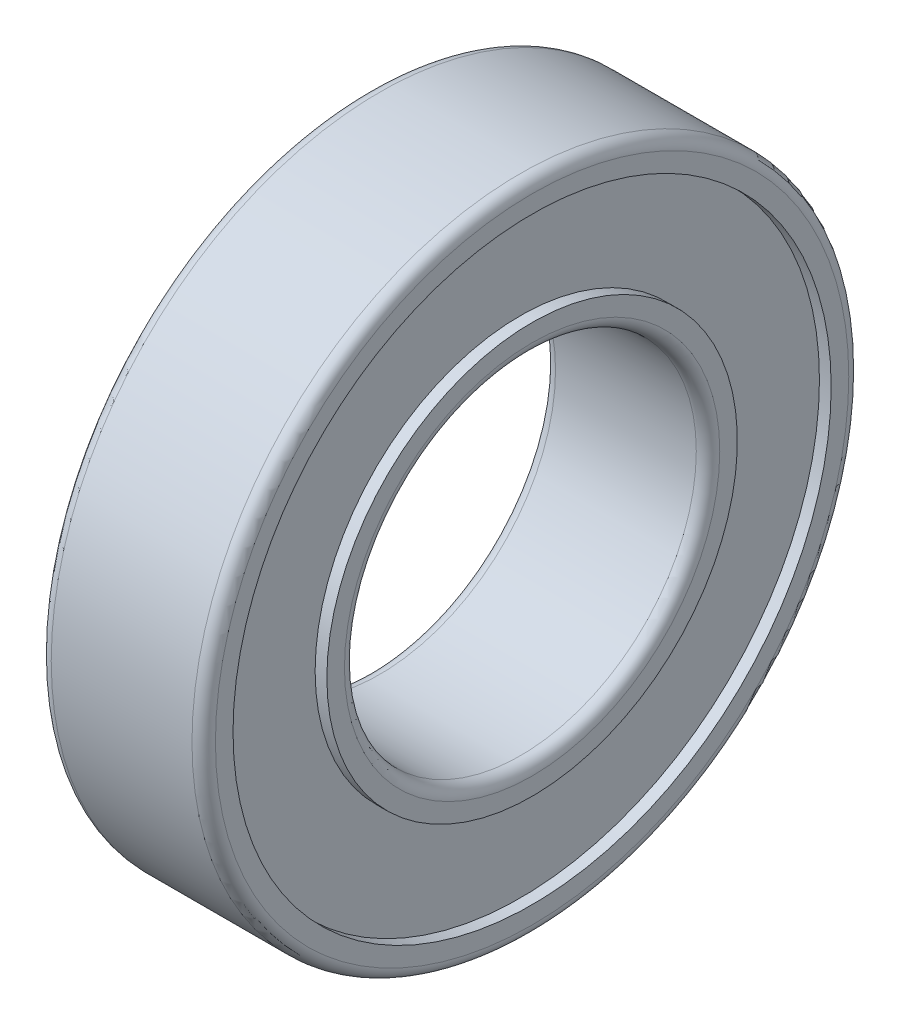
ISO-10303-21;
HEADER;
FILE_DESCRIPTION(('STEP AP214'),'2;1');
FILE_NAME('part.step','',(''),(''),'','','');
FILE_SCHEMA(('AUTOMOTIVE_DESIGN { 1 0 10303 214 1 1 1 1 }'));
ENDSEC;
DATA;
#1=APPLICATION_CONTEXT('core data for automotive mechanical design processes');
#2=APPLICATION_PROTOCOL_DEFINITION('international standard','automotive_design',2000,#1);
#3=PRODUCT_CONTEXT('',#1,'mechanical');
#4=PRODUCT('Part','Part','',(#3));
#5=PRODUCT_RELATED_PRODUCT_CATEGORY('part','',(#4));
#6=PRODUCT_DEFINITION_FORMATION('','',#4);
#7=PRODUCT_DEFINITION_CONTEXT('part definition',#1,'design');
#8=PRODUCT_DEFINITION('design','',#6,#7);
#9=PRODUCT_DEFINITION_SHAPE('','',#8);
#10=(LENGTH_UNIT() NAMED_UNIT(*) SI_UNIT(.MILLI.,.METRE.));
#11=(NAMED_UNIT(*) PLANE_ANGLE_UNIT() SI_UNIT($,.RADIAN.));
#12=(NAMED_UNIT(*) SI_UNIT($,.STERADIAN.) SOLID_ANGLE_UNIT());
#13=UNCERTAINTY_MEASURE_WITH_UNIT(LENGTH_MEASURE(1.E-05),#10,'distance_accuracy_value','');
#14=(GEOMETRIC_REPRESENTATION_CONTEXT(3) GLOBAL_UNCERTAINTY_ASSIGNED_CONTEXT((#13)) GLOBAL_UNIT_ASSIGNED_CONTEXT((#10,
#11,#12)) REPRESENTATION_CONTEXT('',''));
#15=CARTESIAN_POINT('',(0.,0.,0.));
#16=DIRECTION('',(0.,0.,1.));
#17=DIRECTION('',(1.,0.,0.));
#18=AXIS2_PLACEMENT_3D('',#15,#16,#17);
#19=CARTESIAN_POINT('',(0.5,12.75,0.));
#20=DIRECTION('',(1.,0.,0.));
#21=DIRECTION('',(0.,0.,-1.));
#22=AXIS2_PLACEMENT_3D('',#19,#20,#21);
#23=PLANE('',#22);
#24=CARTESIAN_POINT('',(0.5,0.,0.));
#25=DIRECTION('',(-1.,0.,0.));
#26=DIRECTION('',(0.,0.,1.));
#27=AXIS2_PLACEMENT_3D('',#24,#25,#26);
#28=CIRCLE('',#27,8.75);
#29=CARTESIAN_POINT('',(0.5,0.,8.75));
#30=VERTEX_POINT('',#29);
#31=EDGE_CURVE('E305',#30,#30,#28,.T.);
#32=ORIENTED_EDGE('',*,*,#31,.F.);
#33=EDGE_LOOP('',(#32));
#34=FACE_BOUND('',#33,.T.);
#35=CARTESIAN_POINT('',(0.5,0.,0.));
#36=DIRECTION('',(-1.,0.,0.));
#37=DIRECTION('',(0.,0.,1.));
#38=AXIS2_PLACEMENT_3D('',#35,#36,#37);
#39=CIRCLE('',#38,12.75);
#40=CARTESIAN_POINT('',(0.5,0.,12.75));
#41=VERTEX_POINT('',#40);
#42=EDGE_CURVE('E307',#41,#41,#39,.T.);
#43=ORIENTED_EDGE('',*,*,#42,.T.);
#44=EDGE_LOOP('',(#43));
#45=FACE_BOUND('',#44,.T.);
#46=ADVANCED_FACE('F17',(#34,#45),#23,.F.);
#47=CARTESIAN_POINT('',(0.,0.,0.));
#48=DIRECTION('',(-1.,0.,0.));
#49=DIRECTION('',(0.,0.,1.));
#50=AXIS2_PLACEMENT_3D('',#47,#48,#49);
#51=CYLINDRICAL_SURFACE('',#50,12.75);
#52=ORIENTED_EDGE('',*,*,#42,.F.);
#53=EDGE_LOOP('',(#52));
#54=FACE_BOUND('',#53,.T.);
#55=CARTESIAN_POINT('',(0.,0.,0.));
#56=DIRECTION('',(-1.,0.,0.));
#57=DIRECTION('',(0.,0.,1.));
#58=AXIS2_PLACEMENT_3D('',#55,#56,#57);
#59=CIRCLE('',#58,12.75);
#60=CARTESIAN_POINT('',(0.,0.,12.75));
#61=VERTEX_POINT('',#60);
#62=EDGE_CURVE('E302',#61,#61,#59,.T.);
#63=ORIENTED_EDGE('',*,*,#62,.T.);
#64=EDGE_LOOP('',(#63));
#65=FACE_BOUND('',#64,.T.);
#66=ADVANCED_FACE('F102',(#54,#65),#51,.F.);
#67=CARTESIAN_POINT('',(0.,0.,0.));
#68=DIRECTION('',(-1.,0.,0.));
#69=DIRECTION('',(0.,0.,1.));
#70=AXIS2_PLACEMENT_3D('',#67,#68,#69);
#71=CYLINDRICAL_SURFACE('',#70,8.75);
#72=CARTESIAN_POINT('',(0.,0.,0.));
#73=DIRECTION('',(-1.,0.,0.));
#74=DIRECTION('',(0.,0.,1.));
#75=AXIS2_PLACEMENT_3D('',#72,#73,#74);
#76=CIRCLE('',#75,8.75);
#77=CARTESIAN_POINT('',(0.,0.,8.75));
#78=VERTEX_POINT('',#77);
#79=EDGE_CURVE('E70',#78,#78,#76,.F.);
#80=ORIENTED_EDGE('',*,*,#79,.T.);
#81=EDGE_LOOP('',(#80));
#82=FACE_BOUND('',#81,.T.);
#83=ORIENTED_EDGE('',*,*,#31,.T.);
#84=EDGE_LOOP('',(#83));
#85=FACE_BOUND('',#84,.T.);
#86=ADVANCED_FACE('F90',(#82,#85),#71,.T.);
#87=CARTESIAN_POINT('',(0.,14.,0.));
#88=DIRECTION('',(1.,0.,0.));
#89=DIRECTION('',(0.,0.,-1.));
#90=AXIS2_PLACEMENT_3D('',#87,#88,#89);
#91=PLANE('',#90);
#92=ORIENTED_EDGE('',*,*,#62,.F.);
#93=EDGE_LOOP('',(#92));
#94=FACE_BOUND('',#93,.T.);
#95=CARTESIAN_POINT('',(0.,0.,0.));
#96=DIRECTION('',(1.,0.,0.));
#97=DIRECTION('',(0.,0.,-1.));
#98=AXIS2_PLACEMENT_3D('',#95,#96,#97);
#99=CIRCLE('',#98,13.5);
#100=CARTESIAN_POINT('',(0.,0.,-13.5));
#101=VERTEX_POINT('',#100);
#102=CARTESIAN_POINT('',(0.,0.,13.5));
#103=VERTEX_POINT('',#102);
#104=EDGE_CURVE('E57',#101,#103,#99,.T.);
#105=ORIENTED_EDGE('',*,*,#104,.F.);
#106=CARTESIAN_POINT('',(0.,0.,0.));
#107=DIRECTION('',(1.,0.,0.));
#108=DIRECTION('',(0.,0.,1.));
#109=AXIS2_PLACEMENT_3D('',#106,#107,#108);
#110=CIRCLE('',#109,13.5);
#111=EDGE_CURVE('E59',#103,#101,#110,.T.);
#112=ORIENTED_EDGE('',*,*,#111,.F.);
#113=EDGE_LOOP('',(#105,#112));
#114=FACE_BOUND('',#113,.T.);
#115=ADVANCED_FACE('F69',(#94,#114),#91,.F.);
#116=CARTESIAN_POINT('',(0.,8.75,0.));
#117=DIRECTION('',(1.,0.,0.));
#118=DIRECTION('',(0.,0.,-1.));
#119=AXIS2_PLACEMENT_3D('',#116,#117,#118);
#120=PLANE('',#119);
#121=CARTESIAN_POINT('',(0.,0.,0.));
#122=DIRECTION('',(-1.,0.,0.));
#123=DIRECTION('',(0.,0.,-1.));
#124=AXIS2_PLACEMENT_3D('',#121,#122,#123);
#125=CIRCLE('',#124,8.);
#126=CARTESIAN_POINT('',(0.,0.,-8.));
#127=VERTEX_POINT('',#126);
#128=CARTESIAN_POINT('',(0.,0.,8.));
#129=VERTEX_POINT('',#128);
#130=EDGE_CURVE('E65',#127,#129,#125,.T.);
#131=ORIENTED_EDGE('',*,*,#130,.F.);
#132=CARTESIAN_POINT('',(0.,0.,0.));
#133=DIRECTION('',(-1.,0.,0.));
#134=DIRECTION('',(0.,0.,1.));
#135=AXIS2_PLACEMENT_3D('',#132,#133,#134);
#136=CIRCLE('',#135,8.);
#137=EDGE_CURVE('E233',#129,#127,#136,.T.);
#138=ORIENTED_EDGE('',*,*,#137,.F.);
#139=EDGE_LOOP('',(#131,#138));
#140=FACE_BOUND('',#139,.T.);
#141=ORIENTED_EDGE('',*,*,#79,.F.);
#142=EDGE_LOOP('',(#141));
#143=FACE_BOUND('',#142,.T.);
#144=ADVANCED_FACE('F89',(#140,#143),#120,.F.);
#145=CARTESIAN_POINT('',(0.5,0.,0.));
#146=DIRECTION('',(1.,0.,0.));
#147=DIRECTION('',(0.,0.,1.));
#148=AXIS2_PLACEMENT_3D('',#145,#146,#147);
#149=TOROIDAL_SURFACE('',#148,13.5,0.5);
#150=ORIENTED_EDGE('',*,*,#104,.T.);
#151=ORIENTED_EDGE('',*,*,#111,.T.);
#152=EDGE_LOOP('',(#150,#151));
#153=FACE_BOUND('',#152,.T.);
#154=CARTESIAN_POINT('',(0.5,0.,0.));
#155=DIRECTION('',(-1.,0.,0.));
#156=DIRECTION('',(0.,0.,1.));
#157=AXIS2_PLACEMENT_3D('',#154,#155,#156);
#158=CIRCLE('',#157,14.);
#159=CARTESIAN_POINT('',(0.5,0.,14.));
#160=VERTEX_POINT('',#159);
#161=EDGE_CURVE('E230',#160,#160,#158,.F.);
#162=ORIENTED_EDGE('',*,*,#161,.F.);
#163=EDGE_LOOP('',(#162));
#164=FACE_BOUND('',#163,.T.);
#165=ADVANCED_FACE('F61',(#153,#164),#149,.T.);
#166=CARTESIAN_POINT('',(0.5,0.,0.));
#167=DIRECTION('',(1.,0.,0.));
#168=DIRECTION('',(0.,0.,-1.));
#169=AXIS2_PLACEMENT_3D('',#166,#167,#168);
#170=TOROIDAL_SURFACE('',#169,8.,0.5);
#171=ORIENTED_EDGE('',*,*,#130,.T.);
#172=ORIENTED_EDGE('',*,*,#137,.T.);
#173=EDGE_LOOP('',(#171,#172));
#174=FACE_BOUND('',#173,.T.);
#175=CARTESIAN_POINT('',(0.5,0.,0.));
#176=DIRECTION('',(-1.,0.,0.));
#177=DIRECTION('',(0.,0.,1.));
#178=AXIS2_PLACEMENT_3D('',#175,#176,#177);
#179=CIRCLE('',#178,7.5);
#180=CARTESIAN_POINT('',(0.5,0.,7.5));
#181=VERTEX_POINT('',#180);
#182=EDGE_CURVE('E226',#181,#181,#179,.F.);
#183=ORIENTED_EDGE('',*,*,#182,.T.);
#184=EDGE_LOOP('',(#183));
#185=FACE_BOUND('',#184,.T.);
#186=ADVANCED_FACE('F210',(#174,#185),#170,.T.);
#187=CARTESIAN_POINT('',(0.,0.,0.));
#188=DIRECTION('',(-1.,0.,0.));
#189=DIRECTION('',(0.,0.,1.));
#190=AXIS2_PLACEMENT_3D('',#187,#188,#189);
#191=CYLINDRICAL_SURFACE('',#190,14.);
#192=CARTESIAN_POINT('',(6.5,0.,0.));
#193=DIRECTION('',(-1.,0.,0.));
#194=DIRECTION('',(0.,0.,-1.));
#195=AXIS2_PLACEMENT_3D('',#192,#193,#194);
#196=CIRCLE('',#195,14.);
#197=CARTESIAN_POINT('',(6.5,0.,-14.));
#198=VERTEX_POINT('',#197);
#199=EDGE_CURVE('E256',#198,#198,#196,.F.);
#200=ORIENTED_EDGE('',*,*,#199,.F.);
#201=EDGE_LOOP('',(#200));
#202=FACE_BOUND('',#201,.T.);
#203=ORIENTED_EDGE('',*,*,#161,.T.);
#204=EDGE_LOOP('',(#203));
#205=FACE_BOUND('',#204,.T.);
#206=ADVANCED_FACE('F220',(#202,#205),#191,.T.);
#207=CARTESIAN_POINT('',(0.,0.,0.));
#208=DIRECTION('',(-1.,0.,0.));
#209=DIRECTION('',(0.,0.,1.));
#210=AXIS2_PLACEMENT_3D('',#207,#208,#209);
#211=CYLINDRICAL_SURFACE('',#210,7.5);
#212=CARTESIAN_POINT('',(6.5,0.,0.));
#213=DIRECTION('',(-1.,0.,0.));
#214=DIRECTION('',(0.,0.,1.));
#215=AXIS2_PLACEMENT_3D('',#212,#213,#214);
#216=CIRCLE('',#215,7.5);
#217=CARTESIAN_POINT('',(6.5,0.,7.5));
#218=VERTEX_POINT('',#217);
#219=EDGE_CURVE('E258',#218,#218,#216,.T.);
#220=ORIENTED_EDGE('',*,*,#219,.F.);
#221=EDGE_LOOP('',(#220));
#222=FACE_BOUND('',#221,.T.);
#223=ORIENTED_EDGE('',*,*,#182,.F.);
#224=EDGE_LOOP('',(#223));
#225=FACE_BOUND('',#224,.T.);
#226=ADVANCED_FACE('F333',(#222,#225),#211,.F.);
#227=CARTESIAN_POINT('',(6.5,0.,0.));
#228=DIRECTION('',(-1.,0.,0.));
#229=DIRECTION('',(0.,0.,-1.));
#230=AXIS2_PLACEMENT_3D('',#227,#228,#229);
#231=TOROIDAL_SURFACE('',#230,13.5,0.5);
#232=CARTESIAN_POINT('',(7.,0.,0.));
#233=DIRECTION('',(-1.,0.,0.));
#234=DIRECTION('',(0.,0.,1.));
#235=AXIS2_PLACEMENT_3D('',#232,#233,#234);
#236=CIRCLE('',#235,13.5);
#237=CARTESIAN_POINT('',(7.,0.,13.5));
#238=VERTEX_POINT('',#237);
#239=CARTESIAN_POINT('',(7.,0.,-13.5));
#240=VERTEX_POINT('',#239);
#241=EDGE_CURVE('E195',#238,#240,#236,.T.);
#242=ORIENTED_EDGE('',*,*,#241,.T.);
#243=CARTESIAN_POINT('',(7.,0.,0.));
#244=DIRECTION('',(-1.,0.,0.));
#245=DIRECTION('',(0.,0.,-1.));
#246=AXIS2_PLACEMENT_3D('',#243,#244,#245);
#247=CIRCLE('',#246,13.5);
#248=EDGE_CURVE('E155',#240,#238,#247,.T.);
#249=ORIENTED_EDGE('',*,*,#248,.T.);
#250=EDGE_LOOP('',(#242,#249));
#251=FACE_BOUND('',#250,.T.);
#252=ORIENTED_EDGE('',*,*,#199,.T.);
#253=EDGE_LOOP('',(#252));
#254=FACE_BOUND('',#253,.T.);
#255=ADVANCED_FACE('F177',(#251,#254),#231,.T.);
#256=CARTESIAN_POINT('',(6.5,0.,0.));
#257=DIRECTION('',(-1.,0.,0.));
#258=DIRECTION('',(0.,0.,1.));
#259=AXIS2_PLACEMENT_3D('',#256,#257,#258);
#260=TOROIDAL_SURFACE('',#259,8.,0.5);
#261=CARTESIAN_POINT('',(7.,0.,0.));
#262=DIRECTION('',(1.,0.,0.));
#263=DIRECTION('',(0.,0.,1.));
#264=AXIS2_PLACEMENT_3D('',#261,#262,#263);
#265=CIRCLE('',#264,8.);
#266=CARTESIAN_POINT('',(7.,0.,8.));
#267=VERTEX_POINT('',#266);
#268=CARTESIAN_POINT('',(7.,0.,-8.));
#269=VERTEX_POINT('',#268);
#270=EDGE_CURVE('E151',#267,#269,#265,.T.);
#271=ORIENTED_EDGE('',*,*,#270,.T.);
#272=CARTESIAN_POINT('',(7.,0.,0.));
#273=DIRECTION('',(1.,0.,0.));
#274=DIRECTION('',(0.,0.,-1.));
#275=AXIS2_PLACEMENT_3D('',#272,#273,#274);
#276=CIRCLE('',#275,8.);
#277=EDGE_CURVE('E36',#269,#267,#276,.T.);
#278=ORIENTED_EDGE('',*,*,#277,.T.);
#279=EDGE_LOOP('',(#271,#278));
#280=FACE_BOUND('',#279,.T.);
#281=ORIENTED_EDGE('',*,*,#219,.T.);
#282=EDGE_LOOP('',(#281));
#283=FACE_BOUND('',#282,.T.);
#284=ADVANCED_FACE('F157',(#280,#283),#260,.T.);
#285=CARTESIAN_POINT('',(7.,12.75,0.));
#286=DIRECTION('',(-1.,0.,0.));
#287=DIRECTION('',(0.,0.,1.));
#288=AXIS2_PLACEMENT_3D('',#285,#286,#287);
#289=PLANE('',#288);
#290=CARTESIAN_POINT('',(7.,0.,0.));
#291=DIRECTION('',(-1.,0.,0.));
#292=DIRECTION('',(0.,0.,1.));
#293=AXIS2_PLACEMENT_3D('',#290,#291,#292);
#294=CIRCLE('',#293,12.75);
#295=CARTESIAN_POINT('',(7.,0.,12.75));
#296=VERTEX_POINT('',#295);
#297=EDGE_CURVE('E159',#296,#296,#294,.T.);
#298=ORIENTED_EDGE('',*,*,#297,.T.);
#299=EDGE_LOOP('',(#298));
#300=FACE_BOUND('',#299,.T.);
#301=ORIENTED_EDGE('',*,*,#241,.F.);
#302=ORIENTED_EDGE('',*,*,#248,.F.);
#303=EDGE_LOOP('',(#301,#302));
#304=FACE_BOUND('',#303,.T.);
#305=ADVANCED_FACE('F134',(#300,#304),#289,.F.);
#306=CARTESIAN_POINT('',(7.,7.5,0.));
#307=DIRECTION('',(-1.,0.,0.));
#308=DIRECTION('',(0.,0.,1.));
#309=AXIS2_PLACEMENT_3D('',#306,#307,#308);
#310=PLANE('',#309);
#311=ORIENTED_EDGE('',*,*,#270,.F.);
#312=ORIENTED_EDGE('',*,*,#277,.F.);
#313=EDGE_LOOP('',(#311,#312));
#314=FACE_BOUND('',#313,.T.);
#315=CARTESIAN_POINT('',(7.,0.,0.));
#316=DIRECTION('',(-1.,0.,0.));
#317=DIRECTION('',(0.,0.,1.));
#318=AXIS2_PLACEMENT_3D('',#315,#316,#317);
#319=CIRCLE('',#318,8.75);
#320=CARTESIAN_POINT('',(7.,0.,8.75));
#321=VERTEX_POINT('',#320);
#322=EDGE_CURVE('E294',#321,#321,#319,.T.);
#323=ORIENTED_EDGE('',*,*,#322,.F.);
#324=EDGE_LOOP('',(#323));
#325=FACE_BOUND('',#324,.T.);
#326=ADVANCED_FACE('F129',(#314,#325),#310,.F.);
#327=CARTESIAN_POINT('',(0.,0.,0.));
#328=DIRECTION('',(-1.,0.,0.));
#329=DIRECTION('',(0.,0.,1.));
#330=AXIS2_PLACEMENT_3D('',#327,#328,#329);
#331=CYLINDRICAL_SURFACE('',#330,12.75);
#332=ORIENTED_EDGE('',*,*,#297,.F.);
#333=EDGE_LOOP('',(#332));
#334=FACE_BOUND('',#333,.T.);
#335=CARTESIAN_POINT('',(6.5,0.,0.));
#336=DIRECTION('',(-1.,0.,0.));
#337=DIRECTION('',(0.,0.,1.));
#338=AXIS2_PLACEMENT_3D('',#335,#336,#337);
#339=CIRCLE('',#338,12.75);
#340=CARTESIAN_POINT('',(6.5,0.,12.75));
#341=VERTEX_POINT('',#340);
#342=EDGE_CURVE('E28',#341,#341,#339,.T.);
#343=ORIENTED_EDGE('',*,*,#342,.T.);
#344=EDGE_LOOP('',(#343));
#345=FACE_BOUND('',#344,.T.);
#346=ADVANCED_FACE('F121',(#334,#345),#331,.F.);
#347=CARTESIAN_POINT('',(0.,0.,0.));
#348=DIRECTION('',(-1.,0.,0.));
#349=DIRECTION('',(0.,0.,1.));
#350=AXIS2_PLACEMENT_3D('',#347,#348,#349);
#351=CYLINDRICAL_SURFACE('',#350,8.75);
#352=CARTESIAN_POINT('',(6.5,0.,0.));
#353=DIRECTION('',(-1.,0.,0.));
#354=DIRECTION('',(0.,0.,1.));
#355=AXIS2_PLACEMENT_3D('',#352,#353,#354);
#356=CIRCLE('',#355,8.75);
#357=CARTESIAN_POINT('',(6.5,0.,8.75));
#358=VERTEX_POINT('',#357);
#359=EDGE_CURVE('E11',#358,#358,#356,.F.);
#360=ORIENTED_EDGE('',*,*,#359,.T.);
#361=EDGE_LOOP('',(#360));
#362=FACE_BOUND('',#361,.T.);
#363=ORIENTED_EDGE('',*,*,#322,.T.);
#364=EDGE_LOOP('',(#363));
#365=FACE_BOUND('',#364,.T.);
#366=ADVANCED_FACE('F115',(#362,#365),#351,.T.);
#367=CARTESIAN_POINT('',(6.5,8.75,0.));
#368=DIRECTION('',(-1.,0.,0.));
#369=DIRECTION('',(0.,0.,1.));
#370=AXIS2_PLACEMENT_3D('',#367,#368,#369);
#371=PLANE('',#370);
#372=ORIENTED_EDGE('',*,*,#359,.F.);
#373=EDGE_LOOP('',(#372));
#374=FACE_BOUND('',#373,.T.);
#375=ORIENTED_EDGE('',*,*,#342,.F.);
#376=EDGE_LOOP('',(#375));
#377=FACE_BOUND('',#376,.T.);
#378=ADVANCED_FACE('F113',(#374,#377),#371,.F.);
#379=CLOSED_SHELL('',(#46,#66,#86,#115,#144,#165,#186,#206,#226,#255,#284,#305,#326,#346,#366,#378));
#380=MANIFOLD_SOLID_BREP('B1',#379);
#381=ADVANCED_BREP_SHAPE_REPRESENTATION('',(#18,#380),#14);
#382=SHAPE_DEFINITION_REPRESENTATION(#9,#381);
ENDSEC;
END-ISO-10303-21;
